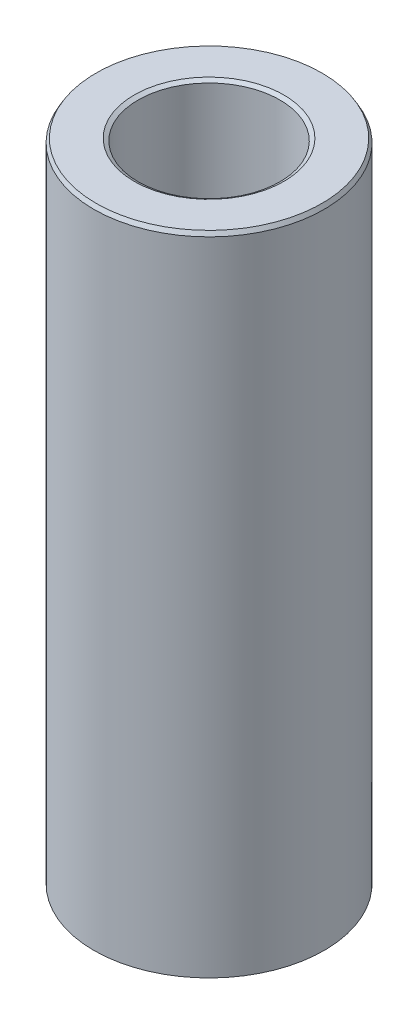
ISO-10303-21;
HEADER;
FILE_DESCRIPTION(('STEP AP214'),'2;1');
FILE_NAME('part.step','',(''),(''),'','','');
FILE_SCHEMA(('AUTOMOTIVE_DESIGN { 1 0 10303 214 1 1 1 1 }'));
ENDSEC;
DATA;
#1=APPLICATION_CONTEXT('core data for automotive mechanical design processes');
#2=APPLICATION_PROTOCOL_DEFINITION('international standard','automotive_design',2000,#1);
#3=PRODUCT_CONTEXT('',#1,'mechanical');
#4=PRODUCT('Part','Part','',(#3));
#5=PRODUCT_RELATED_PRODUCT_CATEGORY('part','',(#4));
#6=PRODUCT_DEFINITION_FORMATION('','',#4);
#7=PRODUCT_DEFINITION_CONTEXT('part definition',#1,'design');
#8=PRODUCT_DEFINITION('design','',#6,#7);
#9=PRODUCT_DEFINITION_SHAPE('','',#8);
#10=(LENGTH_UNIT() NAMED_UNIT(*) SI_UNIT(.MILLI.,.METRE.));
#11=(NAMED_UNIT(*) PLANE_ANGLE_UNIT() SI_UNIT($,.RADIAN.));
#12=(NAMED_UNIT(*) SI_UNIT($,.STERADIAN.) SOLID_ANGLE_UNIT());
#13=UNCERTAINTY_MEASURE_WITH_UNIT(LENGTH_MEASURE(1.E-05),#10,'distance_accuracy_value','');
#14=(GEOMETRIC_REPRESENTATION_CONTEXT(3) GLOBAL_UNCERTAINTY_ASSIGNED_CONTEXT((#13)) GLOBAL_UNIT_ASSIGNED_CONTEXT((#10,
#11,#12)) REPRESENTATION_CONTEXT('',''));
#15=CARTESIAN_POINT('',(0.,0.,0.));
#16=DIRECTION('',(0.,0.,1.));
#17=DIRECTION('',(1.,0.,0.));
#18=AXIS2_PLACEMENT_3D('',#15,#16,#17);
#19=CARTESIAN_POINT('',(0.,267.124461434592,0.));
#20=DIRECTION('',(0.,-1.,0.));
#21=DIRECTION('',(0.,0.,-1.));
#22=AXIS2_PLACEMENT_3D('',#19,#20,#21);
#23=CYLINDRICAL_SURFACE('',#22,47.5);
#24=CARTESIAN_POINT('',(0.,0.951714104587109,0.));
#25=DIRECTION('',(0.,1.,0.));
#26=DIRECTION('',(0.,0.,1.));
#27=AXIS2_PLACEMENT_3D('',#24,#25,#26);
#28=CIRCLE('',#27,47.5);
#29=CARTESIAN_POINT('',(0.,0.951714104587109,47.5));
#30=VERTEX_POINT('',#29);
#31=EDGE_CURVE('E10',#30,#30,#28,.T.);
#32=ORIENTED_EDGE('',*,*,#31,.T.);
#33=EDGE_LOOP('',(#32));
#34=FACE_BOUND('',#33,.T.);
#35=CARTESIAN_POINT('',(0.,265.476044251167,0.));
#36=DIRECTION('',(0.,1.,0.));
#37=DIRECTION('',(0.,0.,1.));
#38=AXIS2_PLACEMENT_3D('',#35,#36,#37);
#39=CIRCLE('',#38,47.5);
#40=CARTESIAN_POINT('',(0.,265.476044251167,47.5));
#41=VERTEX_POINT('',#40);
#42=EDGE_CURVE('E50',#41,#41,#39,.F.);
#43=ORIENTED_EDGE('',*,*,#42,.T.);
#44=EDGE_LOOP('',(#43));
#45=FACE_BOUND('',#44,.T.);
#46=ADVANCED_FACE('F39',(#34,#45),#23,.T.);
#47=CARTESIAN_POINT('',(0.,267.124461434592,0.));
#48=DIRECTION('',(0.,1.,0.));
#49=DIRECTION('',(0.,0.,1.));
#50=AXIS2_PLACEMENT_3D('',#47,#48,#49);
#51=PLANE('',#50);
#52=CARTESIAN_POINT('',(0.,267.124461434592,0.));
#53=DIRECTION('',(0.,1.,0.));
#54=DIRECTION('',(0.,0.,1.));
#55=AXIS2_PLACEMENT_3D('',#52,#53,#54);
#56=CIRCLE('',#55,30.8680916179243);
#57=CARTESIAN_POINT('',(0.,267.124461434592,30.8680916179243));
#58=VERTEX_POINT('',#57);
#59=EDGE_CURVE('E58',#58,#58,#56,.F.);
#60=ORIENTED_EDGE('',*,*,#59,.T.);
#61=EDGE_LOOP('',(#60));
#62=FACE_BOUND('',#61,.T.);
#63=CARTESIAN_POINT('',(0.,267.124461434592,0.));
#64=DIRECTION('',(0.,1.,0.));
#65=DIRECTION('',(0.,0.,1.));
#66=AXIS2_PLACEMENT_3D('',#63,#64,#65);
#67=CIRCLE('',#66,46.5482858954129);
#68=CARTESIAN_POINT('',(0.,267.124461434592,46.5482858954129));
#69=VERTEX_POINT('',#68);
#70=EDGE_CURVE('E61',#69,#69,#67,.T.);
#71=ORIENTED_EDGE('',*,*,#70,.T.);
#72=EDGE_LOOP('',(#71));
#73=FACE_BOUND('',#72,.T.);
#74=ADVANCED_FACE('F88',(#62,#73),#51,.T.);
#75=CARTESIAN_POINT('',(0.,0.,0.));
#76=DIRECTION('',(0.,1.,0.));
#77=DIRECTION('',(0.,0.,1.));
#78=AXIS2_PLACEMENT_3D('',#75,#76,#77);
#79=PLANE('',#78);
#80=CARTESIAN_POINT('',(0.,0.,0.));
#81=DIRECTION('',(0.,1.,0.));
#82=DIRECTION('',(0.,0.,1.));
#83=AXIS2_PLACEMENT_3D('',#80,#81,#82);
#84=CIRCLE('',#83,30.1713885390865);
#85=CARTESIAN_POINT('',(0.,0.,30.1713885390865));
#86=VERTEX_POINT('',#85);
#87=EDGE_CURVE('E51',#86,#86,#84,.T.);
#88=ORIENTED_EDGE('',*,*,#87,.T.);
#89=EDGE_LOOP('',(#88));
#90=FACE_BOUND('',#89,.T.);
#91=CARTESIAN_POINT('',(0.,0.,0.));
#92=DIRECTION('',(0.,1.,0.));
#93=DIRECTION('',(0.,0.,1.));
#94=AXIS2_PLACEMENT_3D('',#91,#92,#93);
#95=CIRCLE('',#94,45.8515828165751);
#96=CARTESIAN_POINT('',(0.,0.,45.8515828165751));
#97=VERTEX_POINT('',#96);
#98=EDGE_CURVE('E54',#97,#97,#95,.F.);
#99=ORIENTED_EDGE('',*,*,#98,.T.);
#100=EDGE_LOOP('',(#99));
#101=FACE_BOUND('',#100,.T.);
#102=ADVANCED_FACE('F83',(#90,#101),#79,.F.);
#103=CARTESIAN_POINT('',(0.,267.124461434592,0.));
#104=DIRECTION('',(0.,-1.,0.));
#105=DIRECTION('',(0.,0.,-1.));
#106=AXIS2_PLACEMENT_3D('',#103,#104,#105);
#107=CYLINDRICAL_SURFACE('',#106,29.2196744344993);
#108=CARTESIAN_POINT('',(0.,266.172747330004,0.));
#109=DIRECTION('',(0.,1.,0.));
#110=DIRECTION('',(0.,0.,1.));
#111=AXIS2_PLACEMENT_3D('',#108,#109,#110);
#112=CIRCLE('',#111,29.2196744344993);
#113=CARTESIAN_POINT('',(0.,266.172747330004,29.2196744344993));
#114=VERTEX_POINT('',#113);
#115=EDGE_CURVE('E67',#114,#114,#112,.T.);
#116=ORIENTED_EDGE('',*,*,#115,.T.);
#117=EDGE_LOOP('',(#116));
#118=FACE_BOUND('',#117,.T.);
#119=CARTESIAN_POINT('',(0.,1.64841718342484,0.));
#120=DIRECTION('',(0.,1.,0.));
#121=DIRECTION('',(0.,0.,1.));
#122=AXIS2_PLACEMENT_3D('',#119,#120,#121);
#123=CIRCLE('',#122,29.2196744344993);
#124=CARTESIAN_POINT('',(0.,1.64841718342484,29.2196744344993));
#125=VERTEX_POINT('',#124);
#126=EDGE_CURVE('E69',#125,#125,#123,.F.);
#127=ORIENTED_EDGE('',*,*,#126,.T.);
#128=EDGE_LOOP('',(#127));
#129=FACE_BOUND('',#128,.T.);
#130=ADVANCED_FACE('F71',(#118,#129),#107,.F.);
#131=CARTESIAN_POINT('',(0.,266.172747330004,0.));
#132=DIRECTION('',(0.,1.,0.));
#133=DIRECTION('',(0.,0.,1.));
#134=AXIS2_PLACEMENT_3D('',#131,#132,#133);
#135=CONICAL_SURFACE('',#134,29.2196744344993,1.04719755119661);
#136=ORIENTED_EDGE('',*,*,#59,.F.);
#137=EDGE_LOOP('',(#136));
#138=FACE_BOUND('',#137,.T.);
#139=ORIENTED_EDGE('',*,*,#115,.F.);
#140=EDGE_LOOP('',(#139));
#141=FACE_BOUND('',#140,.T.);
#142=ADVANCED_FACE('F77',(#138,#141),#135,.F.);
#143=CARTESIAN_POINT('',(0.,0.,0.));
#144=DIRECTION('',(0.,-1.,0.));
#145=DIRECTION('',(0.,0.,-1.));
#146=AXIS2_PLACEMENT_3D('',#143,#144,#145);
#147=CONICAL_SURFACE('',#146,30.1713885390865,0.523598775598295);
#148=ORIENTED_EDGE('',*,*,#126,.F.);
#149=EDGE_LOOP('',(#148));
#150=FACE_BOUND('',#149,.T.);
#151=ORIENTED_EDGE('',*,*,#87,.F.);
#152=EDGE_LOOP('',(#151));
#153=FACE_BOUND('',#152,.T.);
#154=ADVANCED_FACE('F73',(#150,#153),#147,.F.);
#155=CARTESIAN_POINT('',(0.,0.951714104587109,0.));
#156=DIRECTION('',(0.,1.,0.));
#157=DIRECTION('',(0.,0.,1.));
#158=AXIS2_PLACEMENT_3D('',#155,#156,#157);
#159=CONICAL_SURFACE('',#158,47.5,1.04719755119662);
#160=ORIENTED_EDGE('',*,*,#98,.F.);
#161=EDGE_LOOP('',(#160));
#162=FACE_BOUND('',#161,.T.);
#163=ORIENTED_EDGE('',*,*,#31,.F.);
#164=EDGE_LOOP('',(#163));
#165=FACE_BOUND('',#164,.T.);
#166=ADVANCED_FACE('F76',(#162,#165),#159,.T.);
#167=CARTESIAN_POINT('',(0.,267.124461434592,0.));
#168=DIRECTION('',(0.,-1.,0.));
#169=DIRECTION('',(0.,0.,-1.));
#170=AXIS2_PLACEMENT_3D('',#167,#168,#169);
#171=CONICAL_SURFACE('',#170,46.5482858954129,0.523598775598308);
#172=ORIENTED_EDGE('',*,*,#42,.F.);
#173=EDGE_LOOP('',(#172));
#174=FACE_BOUND('',#173,.T.);
#175=ORIENTED_EDGE('',*,*,#70,.F.);
#176=EDGE_LOOP('',(#175));
#177=FACE_BOUND('',#176,.T.);
#178=ADVANCED_FACE('F45',(#174,#177),#171,.T.);
#179=CLOSED_SHELL('',(#46,#74,#102,#130,#142,#154,#166,#178));
#180=MANIFOLD_SOLID_BREP('B2',#179);
#181=ADVANCED_BREP_SHAPE_REPRESENTATION('',(#18,#180),#14);
#182=SHAPE_DEFINITION_REPRESENTATION(#9,#181);
ENDSEC;
END-ISO-10303-21;
